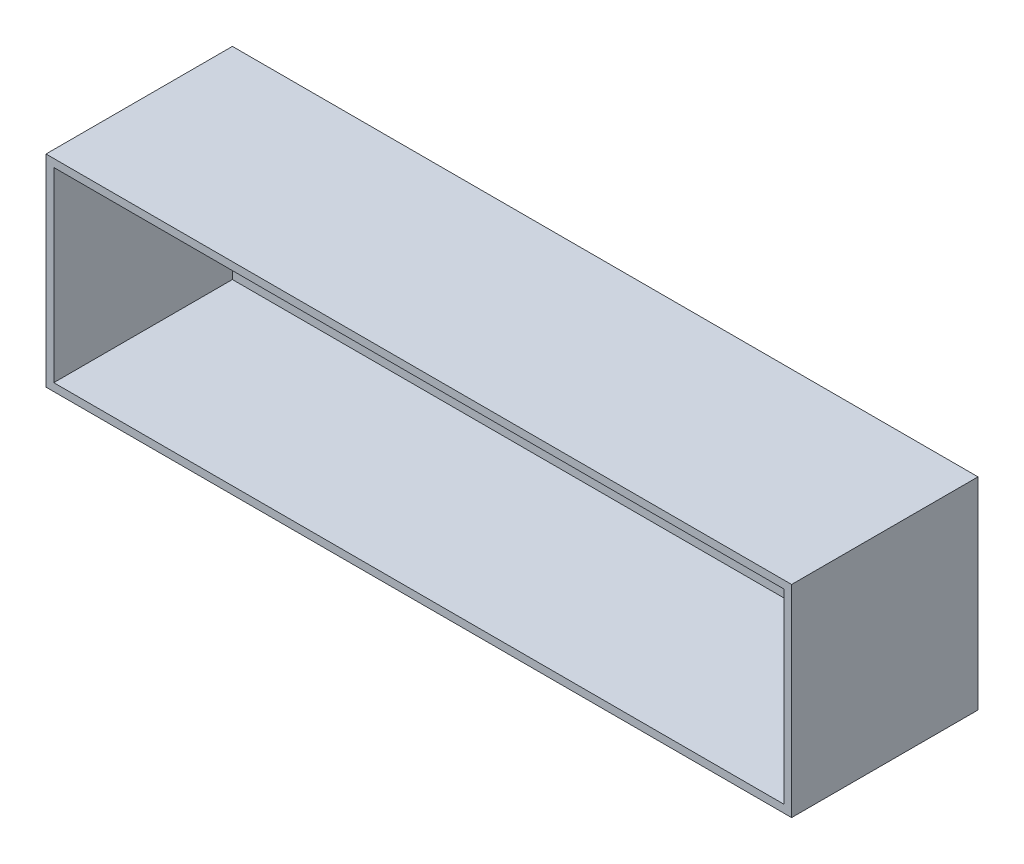
ISO-10303-21;
HEADER;
FILE_DESCRIPTION(('STEP AP214'),'2;1');
FILE_NAME('part.step','',(''),(''),'','','');
FILE_SCHEMA(('AUTOMOTIVE_DESIGN { 1 0 10303 214 1 1 1 1 }'));
ENDSEC;
DATA;
#1=APPLICATION_CONTEXT('core data for automotive mechanical design processes');
#2=APPLICATION_PROTOCOL_DEFINITION('international standard','automotive_design',2000,#1);
#3=PRODUCT_CONTEXT('',#1,'mechanical');
#4=PRODUCT('Part','Part','',(#3));
#5=PRODUCT_RELATED_PRODUCT_CATEGORY('part','',(#4));
#6=PRODUCT_DEFINITION_FORMATION('','',#4);
#7=PRODUCT_DEFINITION_CONTEXT('part definition',#1,'design');
#8=PRODUCT_DEFINITION('design','',#6,#7);
#9=PRODUCT_DEFINITION_SHAPE('','',#8);
#10=(LENGTH_UNIT() NAMED_UNIT(*) SI_UNIT(.MILLI.,.METRE.));
#11=(NAMED_UNIT(*) PLANE_ANGLE_UNIT() SI_UNIT($,.RADIAN.));
#12=(NAMED_UNIT(*) SI_UNIT($,.STERADIAN.) SOLID_ANGLE_UNIT());
#13=UNCERTAINTY_MEASURE_WITH_UNIT(LENGTH_MEASURE(1.E-05),#10,'distance_accuracy_value','');
#14=(GEOMETRIC_REPRESENTATION_CONTEXT(3) GLOBAL_UNCERTAINTY_ASSIGNED_CONTEXT((#13)) GLOBAL_UNIT_ASSIGNED_CONTEXT((#10,
#11,#12)) REPRESENTATION_CONTEXT('',''));
#15=CARTESIAN_POINT('',(0.,0.,0.));
#16=DIRECTION('',(0.,0.,1.));
#17=DIRECTION('',(1.,0.,0.));
#18=AXIS2_PLACEMENT_3D('',#15,#16,#17);
#19=CARTESIAN_POINT('',(0.,0.,-146.05));
#20=DIRECTION('',(0.,0.,1.));
#21=DIRECTION('',(1.,0.,0.));
#22=AXIS2_PLACEMENT_3D('',#19,#20,#21);
#23=PLANE('',#22);
#24=DIRECTION('',(0.,1.,0.));
#25=VECTOR('',#24,1.);
#26=CARTESIAN_POINT('',(184.15,6.35,-146.05));
#27=LINE('',#26,#25);
#28=CARTESIAN_POINT('',(184.15,6.35,-146.05));
#29=VERTEX_POINT('',#28);
#30=CARTESIAN_POINT('',(184.15,82.55,-146.05));
#31=VERTEX_POINT('',#30);
#32=EDGE_CURVE('E126',#29,#31,#27,.T.);
#33=ORIENTED_EDGE('',*,*,#32,.T.);
#34=DIRECTION('',(1.,0.,0.));
#35=VECTOR('',#34,1.);
#36=CARTESIAN_POINT('',(298.45,82.55,-146.05));
#37=LINE('',#36,#35);
#38=CARTESIAN_POINT('',(298.45,82.55,-146.05));
#39=VERTEX_POINT('',#38);
#40=EDGE_CURVE('E282',#31,#39,#37,.T.);
#41=ORIENTED_EDGE('',*,*,#40,.T.);
#42=DIRECTION('',(0.,1.,0.));
#43=VECTOR('',#42,1.);
#44=CARTESIAN_POINT('',(298.45,2.00694162143778E-13,-146.05));
#45=LINE('',#44,#43);
#46=CARTESIAN_POINT('',(298.45,158.75,-146.05));
#47=VERTEX_POINT('',#46);
#48=EDGE_CURVE('E167',#39,#47,#45,.T.);
#49=ORIENTED_EDGE('',*,*,#48,.T.);
#50=DIRECTION('',(-1.,0.,0.));
#51=VECTOR('',#50,1.);
#52=CARTESIAN_POINT('',(0.,158.75,-146.05));
#53=LINE('',#52,#51);
#54=CARTESIAN_POINT('',(-298.45,158.75,-146.05));
#55=VERTEX_POINT('',#54);
#56=EDGE_CURVE('E158',#47,#55,#53,.T.);
#57=ORIENTED_EDGE('',*,*,#56,.T.);
#58=DIRECTION('',(0.,-1.,0.));
#59=VECTOR('',#58,1.);
#60=CARTESIAN_POINT('',(-298.45,0.,-146.05));
#61=LINE('',#60,#59);
#62=CARTESIAN_POINT('',(-298.45,6.35,-146.05));
#63=VERTEX_POINT('',#62);
#64=EDGE_CURVE('E150',#55,#63,#61,.T.);
#65=ORIENTED_EDGE('',*,*,#64,.T.);
#66=DIRECTION('',(1.,0.,0.));
#67=VECTOR('',#66,1.);
#68=CARTESIAN_POINT('',(0.,6.35,-146.05));
#69=LINE('',#68,#67);
#70=EDGE_CURVE('E141',#63,#29,#69,.T.);
#71=ORIENTED_EDGE('',*,*,#70,.T.);
#72=EDGE_LOOP('',(#33,#41,#49,#57,#65,#71));
#73=FACE_BOUND('',#72,.T.);
#74=ADVANCED_FACE('F43',(#73),#23,.T.);
#75=CARTESIAN_POINT('',(304.8,165.1,-152.4));
#76=DIRECTION('',(1.,0.,0.));
#77=DIRECTION('',(0.,1.,0.));
#78=AXIS2_PLACEMENT_3D('',#75,#76,#77);
#79=PLANE('',#78);
#80=DIRECTION('',(0.,1.,0.));
#81=VECTOR('',#80,1.);
#82=CARTESIAN_POINT('',(304.8,165.1,0.));
#83=LINE('',#82,#81);
#84=CARTESIAN_POINT('',(304.8,0.,0.));
#85=VERTEX_POINT('',#84);
#86=CARTESIAN_POINT('',(304.8,165.1,0.));
#87=VERTEX_POINT('',#86);
#88=EDGE_CURVE('E200',#85,#87,#83,.T.);
#89=ORIENTED_EDGE('',*,*,#88,.F.);
#90=DIRECTION('',(0.,0.,1.));
#91=VECTOR('',#90,1.);
#92=CARTESIAN_POINT('',(304.8,0.,-152.4));
#93=LINE('',#92,#91);
#94=CARTESIAN_POINT('',(304.8,0.,-152.4));
#95=VERTEX_POINT('',#94);
#96=EDGE_CURVE('E11',#95,#85,#93,.T.);
#97=ORIENTED_EDGE('',*,*,#96,.F.);
#98=DIRECTION('',(0.,1.,0.));
#99=VECTOR('',#98,1.);
#100=CARTESIAN_POINT('',(304.8,165.1,-152.4));
#101=LINE('',#100,#99);
#102=CARTESIAN_POINT('',(304.8,165.1,-152.4));
#103=VERTEX_POINT('',#102);
#104=EDGE_CURVE('E183',#95,#103,#101,.T.);
#105=ORIENTED_EDGE('',*,*,#104,.T.);
#106=DIRECTION('',(0.,0.,1.));
#107=VECTOR('',#106,1.);
#108=CARTESIAN_POINT('',(304.8,165.1,-152.4));
#109=LINE('',#108,#107);
#110=EDGE_CURVE('E47',#103,#87,#109,.T.);
#111=ORIENTED_EDGE('',*,*,#110,.T.);
#112=EDGE_LOOP('',(#89,#97,#105,#111));
#113=FACE_BOUND('',#112,.T.);
#114=ADVANCED_FACE('F45',(#113),#79,.T.);
#115=CARTESIAN_POINT('',(-304.8,0.,-152.4));
#116=DIRECTION('',(0.,-1.,0.));
#117=DIRECTION('',(0.,0.,-1.));
#118=AXIS2_PLACEMENT_3D('',#115,#116,#117);
#119=PLANE('',#118);
#120=DIRECTION('',(1.,0.,0.));
#121=VECTOR('',#120,1.);
#122=CARTESIAN_POINT('',(-304.8,0.,0.));
#123=LINE('',#122,#121);
#124=CARTESIAN_POINT('',(-304.8,0.,0.));
#125=VERTEX_POINT('',#124);
#126=EDGE_CURVE('E188',#125,#85,#123,.T.);
#127=ORIENTED_EDGE('',*,*,#126,.F.);
#128=DIRECTION('',(0.,0.,1.));
#129=VECTOR('',#128,1.);
#130=CARTESIAN_POINT('',(-304.8,0.,-152.4));
#131=LINE('',#130,#129);
#132=CARTESIAN_POINT('',(-304.8,0.,-152.4));
#133=VERTEX_POINT('',#132);
#134=EDGE_CURVE('E53',#133,#125,#131,.T.);
#135=ORIENTED_EDGE('',*,*,#134,.F.);
#136=DIRECTION('',(1.,0.,0.));
#137=VECTOR('',#136,1.);
#138=CARTESIAN_POINT('',(-304.8,0.,-152.4));
#139=LINE('',#138,#137);
#140=EDGE_CURVE('E196',#133,#95,#139,.T.);
#141=ORIENTED_EDGE('',*,*,#140,.T.);
#142=ORIENTED_EDGE('',*,*,#96,.T.);
#143=EDGE_LOOP('',(#127,#135,#141,#142));
#144=FACE_BOUND('',#143,.T.);
#145=ADVANCED_FACE('F232',(#144),#119,.T.);
#146=CARTESIAN_POINT('',(-304.8,0.,-152.4));
#147=DIRECTION('',(-1.,0.,0.));
#148=DIRECTION('',(0.,0.,1.));
#149=AXIS2_PLACEMENT_3D('',#146,#147,#148);
#150=PLANE('',#149);
#151=DIRECTION('',(0.,-1.,0.));
#152=VECTOR('',#151,1.);
#153=CARTESIAN_POINT('',(-304.8,0.,0.));
#154=LINE('',#153,#152);
#155=CARTESIAN_POINT('',(-304.8,165.1,0.));
#156=VERTEX_POINT('',#155);
#157=EDGE_CURVE('E209',#156,#125,#154,.T.);
#158=ORIENTED_EDGE('',*,*,#157,.F.);
#159=DIRECTION('',(0.,0.,1.));
#160=VECTOR('',#159,1.);
#161=CARTESIAN_POINT('',(-304.8,165.1,-152.4));
#162=LINE('',#161,#160);
#163=CARTESIAN_POINT('',(-304.8,165.1,-152.4));
#164=VERTEX_POINT('',#163);
#165=EDGE_CURVE('E217',#164,#156,#162,.T.);
#166=ORIENTED_EDGE('',*,*,#165,.F.);
#167=DIRECTION('',(0.,-1.,0.));
#168=VECTOR('',#167,1.);
#169=CARTESIAN_POINT('',(-304.8,0.,-152.4));
#170=LINE('',#169,#168);
#171=EDGE_CURVE('E192',#164,#133,#170,.T.);
#172=ORIENTED_EDGE('',*,*,#171,.T.);
#173=ORIENTED_EDGE('',*,*,#134,.T.);
#174=EDGE_LOOP('',(#158,#166,#172,#173));
#175=FACE_BOUND('',#174,.T.);
#176=ADVANCED_FACE('F238',(#175),#150,.T.);
#177=CARTESIAN_POINT('',(-304.8,165.1,-152.4));
#178=DIRECTION('',(0.,1.,0.));
#179=DIRECTION('',(-1.,0.,0.));
#180=AXIS2_PLACEMENT_3D('',#177,#178,#179);
#181=PLANE('',#180);
#182=DIRECTION('',(-1.,0.,0.));
#183=VECTOR('',#182,1.);
#184=CARTESIAN_POINT('',(-304.8,165.1,0.));
#185=LINE('',#184,#183);
#186=EDGE_CURVE('E204',#87,#156,#185,.T.);
#187=ORIENTED_EDGE('',*,*,#186,.F.);
#188=ORIENTED_EDGE('',*,*,#110,.F.);
#189=DIRECTION('',(-1.,0.,0.));
#190=VECTOR('',#189,1.);
#191=CARTESIAN_POINT('',(-304.8,165.1,-152.4));
#192=LINE('',#191,#190);
#193=EDGE_CURVE('E187',#103,#164,#192,.T.);
#194=ORIENTED_EDGE('',*,*,#193,.T.);
#195=ORIENTED_EDGE('',*,*,#165,.T.);
#196=EDGE_LOOP('',(#187,#188,#194,#195));
#197=FACE_BOUND('',#196,.T.);
#198=ADVANCED_FACE('F227',(#197),#181,.T.);
#199=CARTESIAN_POINT('',(0.,0.,-152.4));
#200=DIRECTION('',(0.,0.,1.));
#201=DIRECTION('',(1.,0.,0.));
#202=AXIS2_PLACEMENT_3D('',#199,#200,#201);
#203=PLANE('',#202);
#204=DIRECTION('',(0.,1.,0.));
#205=VECTOR('',#204,1.);
#206=CARTESIAN_POINT('',(184.15,6.35,-152.4));
#207=LINE('',#206,#205);
#208=CARTESIAN_POINT('',(184.15,6.35,-152.4));
#209=VERTEX_POINT('',#208);
#210=CARTESIAN_POINT('',(184.15,82.55,-152.4));
#211=VERTEX_POINT('',#210);
#212=EDGE_CURVE('E296',#209,#211,#207,.T.);
#213=ORIENTED_EDGE('',*,*,#212,.F.);
#214=DIRECTION('',(-1.,0.,0.));
#215=VECTOR('',#214,1.);
#216=CARTESIAN_POINT('',(298.45,6.35,-152.4));
#217=LINE('',#216,#215);
#218=CARTESIAN_POINT('',(298.45,6.35,-152.4));
#219=VERTEX_POINT('',#218);
#220=EDGE_CURVE('E143',#219,#209,#217,.T.);
#221=ORIENTED_EDGE('',*,*,#220,.F.);
#222=DIRECTION('',(0.,-1.,0.));
#223=VECTOR('',#222,1.);
#224=CARTESIAN_POINT('',(298.45,6.35,-152.4));
#225=LINE('',#224,#223);
#226=CARTESIAN_POINT('',(298.45,82.55,-152.4));
#227=VERTEX_POINT('',#226);
#228=EDGE_CURVE('E275',#227,#219,#225,.T.);
#229=ORIENTED_EDGE('',*,*,#228,.F.);
#230=DIRECTION('',(1.,0.,0.));
#231=VECTOR('',#230,1.);
#232=CARTESIAN_POINT('',(298.45,82.55,-152.4));
#233=LINE('',#232,#231);
#234=EDGE_CURVE('E68',#211,#227,#233,.T.);
#235=ORIENTED_EDGE('',*,*,#234,.F.);
#236=EDGE_LOOP('',(#213,#221,#229,#235));
#237=FACE_BOUND('',#236,.T.);
#238=ORIENTED_EDGE('',*,*,#104,.F.);
#239=ORIENTED_EDGE('',*,*,#140,.F.);
#240=ORIENTED_EDGE('',*,*,#171,.F.);
#241=ORIENTED_EDGE('',*,*,#193,.F.);
#242=EDGE_LOOP('',(#238,#239,#240,#241));
#243=FACE_BOUND('',#242,.T.);
#244=ADVANCED_FACE('F235',(#237,#243),#203,.F.);
#245=CARTESIAN_POINT('',(0.,0.,0.));
#246=DIRECTION('',(0.,0.,1.));
#247=DIRECTION('',(1.,0.,0.));
#248=AXIS2_PLACEMENT_3D('',#245,#246,#247);
#249=PLANE('',#248);
#250=DIRECTION('',(0.,1.,0.));
#251=VECTOR('',#250,1.);
#252=CARTESIAN_POINT('',(298.45,2.00694162143778E-13,0.));
#253=LINE('',#252,#251);
#254=CARTESIAN_POINT('',(298.45,6.35,0.));
#255=VERTEX_POINT('',#254);
#256=CARTESIAN_POINT('',(298.45,158.75,0.));
#257=VERTEX_POINT('',#256);
#258=EDGE_CURVE('E168',#255,#257,#253,.T.);
#259=ORIENTED_EDGE('',*,*,#258,.F.);
#260=DIRECTION('',(1.,0.,0.));
#261=VECTOR('',#260,1.);
#262=CARTESIAN_POINT('',(0.,6.35,0.));
#263=LINE('',#262,#261);
#264=CARTESIAN_POINT('',(-298.45,6.35,0.));
#265=VERTEX_POINT('',#264);
#266=EDGE_CURVE('E180',#265,#255,#263,.T.);
#267=ORIENTED_EDGE('',*,*,#266,.F.);
#268=DIRECTION('',(0.,-1.,0.));
#269=VECTOR('',#268,1.);
#270=CARTESIAN_POINT('',(-298.45,0.,0.));
#271=LINE('',#270,#269);
#272=CARTESIAN_POINT('',(-298.45,158.75,0.));
#273=VERTEX_POINT('',#272);
#274=EDGE_CURVE('E177',#273,#265,#271,.T.);
#275=ORIENTED_EDGE('',*,*,#274,.F.);
#276=DIRECTION('',(-1.,0.,0.));
#277=VECTOR('',#276,1.);
#278=CARTESIAN_POINT('',(0.,158.75,0.));
#279=LINE('',#278,#277);
#280=EDGE_CURVE('E172',#257,#273,#279,.T.);
#281=ORIENTED_EDGE('',*,*,#280,.F.);
#282=EDGE_LOOP('',(#259,#267,#275,#281));
#283=FACE_BOUND('',#282,.T.);
#284=ORIENTED_EDGE('',*,*,#88,.T.);
#285=ORIENTED_EDGE('',*,*,#186,.T.);
#286=ORIENTED_EDGE('',*,*,#157,.T.);
#287=ORIENTED_EDGE('',*,*,#126,.T.);
#288=EDGE_LOOP('',(#284,#285,#286,#287));
#289=FACE_BOUND('',#288,.T.);
#290=ADVANCED_FACE('F229',(#283,#289),#249,.T.);
#291=CARTESIAN_POINT('',(298.45,165.1,-152.4));
#292=DIRECTION('',(1.,0.,0.));
#293=DIRECTION('',(0.,1.,0.));
#294=AXIS2_PLACEMENT_3D('',#291,#292,#293);
#295=PLANE('',#294);
#296=ORIENTED_EDGE('',*,*,#258,.T.);
#297=DIRECTION('',(0.,0.,1.));
#298=VECTOR('',#297,1.);
#299=CARTESIAN_POINT('',(298.45,158.75,-152.4));
#300=LINE('',#299,#298);
#301=EDGE_CURVE('E152',#47,#257,#300,.T.);
#302=ORIENTED_EDGE('',*,*,#301,.F.);
#303=ORIENTED_EDGE('',*,*,#48,.F.);
#304=DIRECTION('',(0.,0.,-1.));
#305=VECTOR('',#304,1.);
#306=CARTESIAN_POINT('',(298.45,82.55,-8.67849640482199));
#307=LINE('',#306,#305);
#308=EDGE_CURVE('E173',#39,#227,#307,.T.);
#309=ORIENTED_EDGE('',*,*,#308,.T.);
#310=ORIENTED_EDGE('',*,*,#228,.T.);
#311=DIRECTION('',(0.,0.,1.));
#312=VECTOR('',#311,1.);
#313=CARTESIAN_POINT('',(298.45,6.35,-152.4));
#314=LINE('',#313,#312);
#315=EDGE_CURVE('E205',#219,#255,#314,.T.);
#316=ORIENTED_EDGE('',*,*,#315,.T.);
#317=EDGE_LOOP('',(#296,#302,#303,#309,#310,#316));
#318=FACE_BOUND('',#317,.T.);
#319=ADVANCED_FACE('F259',(#318),#295,.F.);
#320=CARTESIAN_POINT('',(-304.8,6.35,-152.4));
#321=DIRECTION('',(0.,-1.,0.));
#322=DIRECTION('',(0.,0.,-1.));
#323=AXIS2_PLACEMENT_3D('',#320,#321,#322);
#324=PLANE('',#323);
#325=ORIENTED_EDGE('',*,*,#266,.T.);
#326=ORIENTED_EDGE('',*,*,#315,.F.);
#327=ORIENTED_EDGE('',*,*,#220,.T.);
#328=DIRECTION('',(0.,0.,-1.));
#329=VECTOR('',#328,1.);
#330=CARTESIAN_POINT('',(184.15,6.35,-8.67849640482199));
#331=LINE('',#330,#329);
#332=EDGE_CURVE('E129',#29,#209,#331,.T.);
#333=ORIENTED_EDGE('',*,*,#332,.F.);
#334=ORIENTED_EDGE('',*,*,#70,.F.);
#335=DIRECTION('',(0.,0.,1.));
#336=VECTOR('',#335,1.);
#337=CARTESIAN_POINT('',(-298.45,6.35,-152.4));
#338=LINE('',#337,#336);
#339=EDGE_CURVE('E162',#63,#265,#338,.T.);
#340=ORIENTED_EDGE('',*,*,#339,.T.);
#341=EDGE_LOOP('',(#325,#326,#327,#333,#334,#340));
#342=FACE_BOUND('',#341,.T.);
#343=ADVANCED_FACE('F139',(#342),#324,.F.);
#344=CARTESIAN_POINT('',(-298.45,0.,-152.4));
#345=DIRECTION('',(-1.,0.,0.));
#346=DIRECTION('',(0.,0.,1.));
#347=AXIS2_PLACEMENT_3D('',#344,#345,#346);
#348=PLANE('',#347);
#349=ORIENTED_EDGE('',*,*,#274,.T.);
#350=ORIENTED_EDGE('',*,*,#339,.F.);
#351=ORIENTED_EDGE('',*,*,#64,.F.);
#352=DIRECTION('',(0.,0.,1.));
#353=VECTOR('',#352,1.);
#354=CARTESIAN_POINT('',(-298.45,158.75,-152.4));
#355=LINE('',#354,#353);
#356=EDGE_CURVE('E156',#55,#273,#355,.T.);
#357=ORIENTED_EDGE('',*,*,#356,.T.);
#358=EDGE_LOOP('',(#349,#350,#351,#357));
#359=FACE_BOUND('',#358,.T.);
#360=ADVANCED_FACE('F280',(#359),#348,.F.);
#361=CARTESIAN_POINT('',(-304.8,158.75,-152.4));
#362=DIRECTION('',(0.,1.,0.));
#363=DIRECTION('',(-1.,0.,0.));
#364=AXIS2_PLACEMENT_3D('',#361,#362,#363);
#365=PLANE('',#364);
#366=ORIENTED_EDGE('',*,*,#280,.T.);
#367=ORIENTED_EDGE('',*,*,#356,.F.);
#368=ORIENTED_EDGE('',*,*,#56,.F.);
#369=ORIENTED_EDGE('',*,*,#301,.T.);
#370=EDGE_LOOP('',(#366,#367,#368,#369));
#371=FACE_BOUND('',#370,.T.);
#372=ADVANCED_FACE('F253',(#371),#365,.F.);
#373=CARTESIAN_POINT('',(184.15,6.35,-8.67849640482199));
#374=DIRECTION('',(-1.,0.,0.));
#375=DIRECTION('',(0.,0.,1.));
#376=AXIS2_PLACEMENT_3D('',#373,#374,#375);
#377=PLANE('',#376);
#378=ORIENTED_EDGE('',*,*,#332,.T.);
#379=ORIENTED_EDGE('',*,*,#212,.T.);
#380=DIRECTION('',(0.,0.,-1.));
#381=VECTOR('',#380,1.);
#382=CARTESIAN_POINT('',(184.15,82.55,-8.67849640482199));
#383=LINE('',#382,#381);
#384=EDGE_CURVE('E61',#31,#211,#383,.T.);
#385=ORIENTED_EDGE('',*,*,#384,.F.);
#386=ORIENTED_EDGE('',*,*,#32,.F.);
#387=EDGE_LOOP('',(#378,#379,#385,#386));
#388=FACE_BOUND('',#387,.T.);
#389=ADVANCED_FACE('F128',(#388),#377,.F.);
#390=CARTESIAN_POINT('',(298.45,82.55,-8.67849640482199));
#391=DIRECTION('',(0.,1.,0.));
#392=DIRECTION('',(-1.,0.,0.));
#393=AXIS2_PLACEMENT_3D('',#390,#391,#392);
#394=PLANE('',#393);
#395=ORIENTED_EDGE('',*,*,#384,.T.);
#396=ORIENTED_EDGE('',*,*,#234,.T.);
#397=ORIENTED_EDGE('',*,*,#308,.F.);
#398=ORIENTED_EDGE('',*,*,#40,.F.);
#399=EDGE_LOOP('',(#395,#396,#397,#398));
#400=FACE_BOUND('',#399,.T.);
#401=ADVANCED_FACE('F300',(#400),#394,.F.);
#402=CLOSED_SHELL('',(#74,#114,#145,#176,#198,#244,#290,#319,#343,#360,#372,#389,#401));
#403=MANIFOLD_SOLID_BREP('B2',#402);
#404=ADVANCED_BREP_SHAPE_REPRESENTATION('',(#18,#403),#14);
#405=SHAPE_DEFINITION_REPRESENTATION(#9,#404);
ENDSEC;
END-ISO-10303-21;
